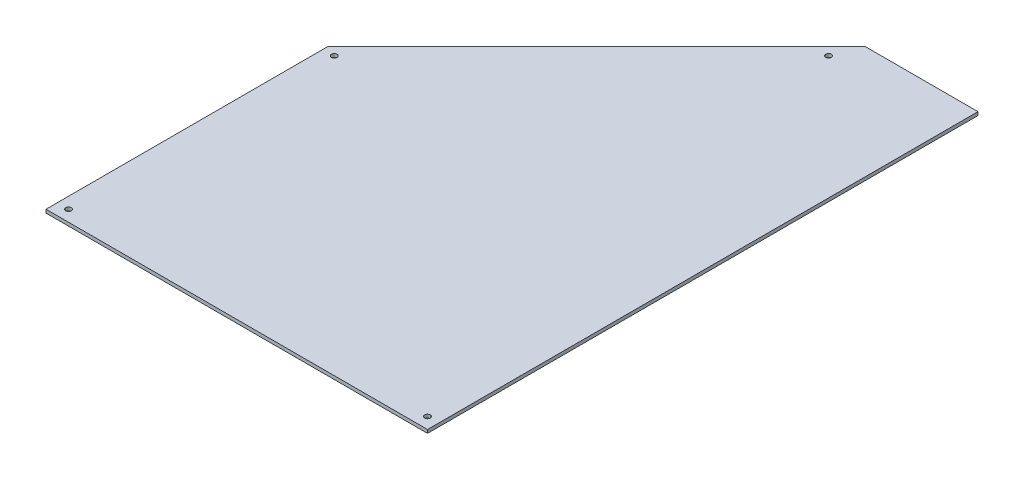
ISO-10303-21;
HEADER;
FILE_DESCRIPTION(('STEP AP214'),'2;1');
FILE_NAME('part.step','',(''),(''),'','','');
FILE_SCHEMA(('AUTOMOTIVE_DESIGN { 1 0 10303 214 1 1 1 1 }'));
ENDSEC;
DATA;
#1=APPLICATION_CONTEXT('core data for automotive mechanical design processes');
#2=APPLICATION_PROTOCOL_DEFINITION('international standard','automotive_design',2000,#1);
#3=PRODUCT_CONTEXT('',#1,'mechanical');
#4=PRODUCT('Part','Part','',(#3));
#5=PRODUCT_RELATED_PRODUCT_CATEGORY('part','',(#4));
#6=PRODUCT_DEFINITION_FORMATION('','',#4);
#7=PRODUCT_DEFINITION_CONTEXT('part definition',#1,'design');
#8=PRODUCT_DEFINITION('design','',#6,#7);
#9=PRODUCT_DEFINITION_SHAPE('','',#8);
#10=(LENGTH_UNIT() NAMED_UNIT(*) SI_UNIT(.MILLI.,.METRE.));
#11=(NAMED_UNIT(*) PLANE_ANGLE_UNIT() SI_UNIT($,.RADIAN.));
#12=(NAMED_UNIT(*) SI_UNIT($,.STERADIAN.) SOLID_ANGLE_UNIT());
#13=UNCERTAINTY_MEASURE_WITH_UNIT(LENGTH_MEASURE(1.E-05),#10,'distance_accuracy_value','');
#14=(GEOMETRIC_REPRESENTATION_CONTEXT(3) GLOBAL_UNCERTAINTY_ASSIGNED_CONTEXT((#13)) GLOBAL_UNIT_ASSIGNED_CONTEXT((#10,
#11,#12)) REPRESENTATION_CONTEXT('',''));
#15=CARTESIAN_POINT('',(0.,0.,0.));
#16=DIRECTION('',(0.,0.,1.));
#17=DIRECTION('',(1.,0.,0.));
#18=AXIS2_PLACEMENT_3D('',#15,#16,#17);
#19=CARTESIAN_POINT('',(488.610000000005,3.,-488.610000000001));
#20=DIRECTION('',(-1.,0.,0.));
#21=DIRECTION('',(0.,0.,1.));
#22=AXIS2_PLACEMENT_3D('',#19,#20,#21);
#23=PLANE('',#22);
#24=DIRECTION('',(0.,0.,-1.));
#25=VECTOR('',#24,1.);
#26=CARTESIAN_POINT('',(488.610000000005,0.,-488.610000000001));
#27=LINE('',#26,#25);
#28=CARTESIAN_POINT('',(488.610000000005,0.,0.));
#29=VERTEX_POINT('',#28);
#30=CARTESIAN_POINT('',(488.610000000005,0.,-488.610000000001));
#31=VERTEX_POINT('',#30);
#32=EDGE_CURVE('E108',#29,#31,#27,.T.);
#33=ORIENTED_EDGE('',*,*,#32,.T.);
#34=DIRECTION('',(0.,-1.,0.));
#35=VECTOR('',#34,1.);
#36=CARTESIAN_POINT('',(488.610000000005,3.,-488.610000000001));
#37=LINE('',#36,#35);
#38=CARTESIAN_POINT('',(488.610000000005,3.,-488.610000000001));
#39=VERTEX_POINT('',#38);
#40=EDGE_CURVE('E11',#39,#31,#37,.T.);
#41=ORIENTED_EDGE('',*,*,#40,.F.);
#42=DIRECTION('',(0.,0.,-1.));
#43=VECTOR('',#42,1.);
#44=CARTESIAN_POINT('',(488.610000000005,3.,-488.610000000001));
#45=LINE('',#44,#43);
#46=CARTESIAN_POINT('',(488.610000000005,3.,0.));
#47=VERTEX_POINT('',#46);
#48=EDGE_CURVE('E117',#47,#39,#45,.T.);
#49=ORIENTED_EDGE('',*,*,#48,.F.);
#50=DIRECTION('',(0.,-1.,0.));
#51=VECTOR('',#50,1.);
#52=CARTESIAN_POINT('',(488.610000000005,3.,0.));
#53=LINE('',#52,#51);
#54=EDGE_CURVE('E104',#47,#29,#53,.T.);
#55=ORIENTED_EDGE('',*,*,#54,.T.);
#56=EDGE_LOOP('',(#33,#41,#49,#55));
#57=FACE_BOUND('',#56,.T.);
#58=ADVANCED_FACE('F34',(#57),#23,.F.);
#59=CARTESIAN_POINT('',(388.610000000005,3.,-488.610000000001));
#60=DIRECTION('',(0.,0.,1.));
#61=DIRECTION('',(1.,0.,0.));
#62=AXIS2_PLACEMENT_3D('',#59,#60,#61);
#63=PLANE('',#62);
#64=DIRECTION('',(-1.,0.,0.));
#65=VECTOR('',#64,1.);
#66=CARTESIAN_POINT('',(388.610000000005,0.,-488.610000000001));
#67=LINE('',#66,#65);
#68=CARTESIAN_POINT('',(388.610000000005,0.,-488.610000000001));
#69=VERTEX_POINT('',#68);
#70=EDGE_CURVE('E111',#31,#69,#67,.T.);
#71=ORIENTED_EDGE('',*,*,#70,.T.);
#72=DIRECTION('',(0.,-1.,0.));
#73=VECTOR('',#72,1.);
#74=CARTESIAN_POINT('',(388.610000000005,3.,-488.610000000001));
#75=LINE('',#74,#73);
#76=CARTESIAN_POINT('',(388.610000000005,3.,-488.610000000001));
#77=VERTEX_POINT('',#76);
#78=EDGE_CURVE('E42',#77,#69,#75,.T.);
#79=ORIENTED_EDGE('',*,*,#78,.F.);
#80=DIRECTION('',(-1.,0.,0.));
#81=VECTOR('',#80,1.);
#82=CARTESIAN_POINT('',(388.610000000005,3.,-488.610000000001));
#83=LINE('',#82,#81);
#84=EDGE_CURVE('E84',#39,#77,#83,.T.);
#85=ORIENTED_EDGE('',*,*,#84,.F.);
#86=ORIENTED_EDGE('',*,*,#40,.T.);
#87=EDGE_LOOP('',(#71,#79,#85,#86));
#88=FACE_BOUND('',#87,.T.);
#89=ADVANCED_FACE('F137',(#88),#63,.F.);
#90=CARTESIAN_POINT('',(150.,3.,-249.999999999998));
#91=DIRECTION('',(0.707106781186544,0.,0.707106781186551));
#92=DIRECTION('',(0.707106781186551,0.,-0.707106781186544));
#93=AXIS2_PLACEMENT_3D('',#90,#91,#92);
#94=PLANE('',#93);
#95=DIRECTION('',(-0.707106781186551,0.,0.707106781186544));
#96=VECTOR('',#95,1.);
#97=CARTESIAN_POINT('',(150.,0.,-249.999999999998));
#98=LINE('',#97,#96);
#99=CARTESIAN_POINT('',(150.,0.,-249.999999999998));
#100=VERTEX_POINT('',#99);
#101=EDGE_CURVE('E99',#69,#100,#98,.T.);
#102=ORIENTED_EDGE('',*,*,#101,.T.);
#103=DIRECTION('',(0.,-1.,0.));
#104=VECTOR('',#103,1.);
#105=CARTESIAN_POINT('',(150.,3.,-249.999999999998));
#106=LINE('',#105,#104);
#107=CARTESIAN_POINT('',(150.,3.,-249.999999999998));
#108=VERTEX_POINT('',#107);
#109=EDGE_CURVE('E96',#108,#100,#106,.T.);
#110=ORIENTED_EDGE('',*,*,#109,.F.);
#111=DIRECTION('',(-0.707106781186551,0.,0.707106781186544));
#112=VECTOR('',#111,1.);
#113=CARTESIAN_POINT('',(150.,3.,-249.999999999998));
#114=LINE('',#113,#112);
#115=EDGE_CURVE('E88',#77,#108,#114,.T.);
#116=ORIENTED_EDGE('',*,*,#115,.F.);
#117=ORIENTED_EDGE('',*,*,#78,.T.);
#118=EDGE_LOOP('',(#102,#110,#116,#117));
#119=FACE_BOUND('',#118,.T.);
#120=ADVANCED_FACE('F97',(#119),#94,.F.);
#121=CARTESIAN_POINT('',(150.,3.,0.));
#122=DIRECTION('',(1.,0.,0.));
#123=DIRECTION('',(0.,0.,-1.));
#124=AXIS2_PLACEMENT_3D('',#121,#122,#123);
#125=PLANE('',#124);
#126=DIRECTION('',(0.,0.,1.));
#127=VECTOR('',#126,1.);
#128=CARTESIAN_POINT('',(150.,0.,0.));
#129=LINE('',#128,#127);
#130=CARTESIAN_POINT('',(150.,0.,0.));
#131=VERTEX_POINT('',#130);
#132=EDGE_CURVE('E70',#100,#131,#129,.T.);
#133=ORIENTED_EDGE('',*,*,#132,.T.);
#134=DIRECTION('',(0.,-1.,0.));
#135=VECTOR('',#134,1.);
#136=CARTESIAN_POINT('',(150.,3.,0.));
#137=LINE('',#136,#135);
#138=CARTESIAN_POINT('',(150.,3.,0.));
#139=VERTEX_POINT('',#138);
#140=EDGE_CURVE('E100',#139,#131,#137,.T.);
#141=ORIENTED_EDGE('',*,*,#140,.F.);
#142=DIRECTION('',(0.,0.,1.));
#143=VECTOR('',#142,1.);
#144=CARTESIAN_POINT('',(150.,3.,0.));
#145=LINE('',#144,#143);
#146=EDGE_CURVE('E92',#108,#139,#145,.T.);
#147=ORIENTED_EDGE('',*,*,#146,.F.);
#148=ORIENTED_EDGE('',*,*,#109,.T.);
#149=EDGE_LOOP('',(#133,#141,#147,#148));
#150=FACE_BOUND('',#149,.T.);
#151=ADVANCED_FACE('F102',(#150),#125,.F.);
#152=CARTESIAN_POINT('',(488.610000000005,3.,0.));
#153=DIRECTION('',(0.,0.,-1.));
#154=DIRECTION('',(-1.,0.,0.));
#155=AXIS2_PLACEMENT_3D('',#152,#153,#154);
#156=PLANE('',#155);
#157=DIRECTION('',(1.,0.,0.));
#158=VECTOR('',#157,1.);
#159=CARTESIAN_POINT('',(488.610000000005,0.,0.));
#160=LINE('',#159,#158);
#161=EDGE_CURVE('E76',#131,#29,#160,.T.);
#162=ORIENTED_EDGE('',*,*,#161,.T.);
#163=ORIENTED_EDGE('',*,*,#54,.F.);
#164=DIRECTION('',(1.,0.,0.));
#165=VECTOR('',#164,1.);
#166=CARTESIAN_POINT('',(488.610000000005,3.,0.));
#167=LINE('',#166,#165);
#168=EDGE_CURVE('E50',#139,#47,#167,.T.);
#169=ORIENTED_EDGE('',*,*,#168,.F.);
#170=ORIENTED_EDGE('',*,*,#140,.T.);
#171=EDGE_LOOP('',(#162,#163,#169,#170));
#172=FACE_BOUND('',#171,.T.);
#173=ADVANCED_FACE('F125',(#172),#156,.F.);
#174=CARTESIAN_POINT('',(0.,3.,0.));
#175=DIRECTION('',(0.,-1.,0.));
#176=DIRECTION('',(0.,0.,-1.));
#177=AXIS2_PLACEMENT_3D('',#174,#175,#176);
#178=PLANE('',#177);
#179=CARTESIAN_POINT('',(379.368855680987,3.,-465.226720057252));
#180=DIRECTION('',(0.,1.,0.));
#181=DIRECTION('',(0.,0.,1.));
#182=AXIS2_PLACEMENT_3D('',#179,#180,#181);
#183=CIRCLE('',#182,2.49999999999997);
#184=CARTESIAN_POINT('',(379.368855680987,3.,-462.726720057252));
#185=VERTEX_POINT('',#184);
#186=EDGE_CURVE('E219',#185,#185,#183,.T.);
#187=ORIENTED_EDGE('',*,*,#186,.F.);
#188=EDGE_LOOP('',(#187));
#189=FACE_BOUND('',#188,.T.);
#190=CARTESIAN_POINT('',(478.610000000005,3.,-10.));
#191=DIRECTION('',(0.,1.,0.));
#192=DIRECTION('',(0.,0.,1.));
#193=AXIS2_PLACEMENT_3D('',#190,#191,#192);
#194=CIRCLE('',#193,2.50000000000002);
#195=CARTESIAN_POINT('',(478.610000000005,3.,-7.49999999999998));
#196=VERTEX_POINT('',#195);
#197=EDGE_CURVE('E221',#196,#196,#194,.T.);
#198=ORIENTED_EDGE('',*,*,#197,.F.);
#199=EDGE_LOOP('',(#198));
#200=FACE_BOUND('',#199,.T.);
#201=CARTESIAN_POINT('',(160.,3.,-10.));
#202=DIRECTION('',(0.,1.,0.));
#203=DIRECTION('',(0.,0.,1.));
#204=AXIS2_PLACEMENT_3D('',#201,#202,#203);
#205=CIRCLE('',#204,2.49999999999999);
#206=CARTESIAN_POINT('',(160.,3.,-7.50000000000001));
#207=VERTEX_POINT('',#206);
#208=EDGE_CURVE('E234',#207,#207,#205,.T.);
#209=ORIENTED_EDGE('',*,*,#208,.F.);
#210=EDGE_LOOP('',(#209));
#211=FACE_BOUND('',#210,.T.);
#212=CARTESIAN_POINT('',(160.,3.,-245.857864376267));
#213=DIRECTION('',(0.,1.,0.));
#214=DIRECTION('',(0.,0.,1.));
#215=AXIS2_PLACEMENT_3D('',#212,#213,#214);
#216=CIRCLE('',#215,2.5);
#217=CARTESIAN_POINT('',(160.,3.,-243.357864376267));
#218=VERTEX_POINT('',#217);
#219=EDGE_CURVE('E227',#218,#218,#216,.T.);
#220=ORIENTED_EDGE('',*,*,#219,.F.);
#221=EDGE_LOOP('',(#220));
#222=FACE_BOUND('',#221,.T.);
#223=ORIENTED_EDGE('',*,*,#48,.T.);
#224=ORIENTED_EDGE('',*,*,#84,.T.);
#225=ORIENTED_EDGE('',*,*,#115,.T.);
#226=ORIENTED_EDGE('',*,*,#146,.T.);
#227=ORIENTED_EDGE('',*,*,#168,.T.);
#228=EDGE_LOOP('',(#223,#224,#225,#226,#227));
#229=FACE_BOUND('',#228,.T.);
#230=ADVANCED_FACE('F90',(#189,#200,#211,#222,#229),#178,.F.);
#231=CARTESIAN_POINT('',(0.,0.,0.));
#232=DIRECTION('',(0.,-1.,0.));
#233=DIRECTION('',(0.,0.,-1.));
#234=AXIS2_PLACEMENT_3D('',#231,#232,#233);
#235=PLANE('',#234);
#236=CARTESIAN_POINT('',(379.368855680987,0.,-465.226720057252));
#237=DIRECTION('',(0.,1.,0.));
#238=DIRECTION('',(0.,0.,1.));
#239=AXIS2_PLACEMENT_3D('',#236,#237,#238);
#240=CIRCLE('',#239,2.49999999999997);
#241=CARTESIAN_POINT('',(379.368855680987,0.,-462.726720057252));
#242=VERTEX_POINT('',#241);
#243=EDGE_CURVE('E216',#242,#242,#240,.T.);
#244=ORIENTED_EDGE('',*,*,#243,.T.);
#245=EDGE_LOOP('',(#244));
#246=FACE_BOUND('',#245,.T.);
#247=CARTESIAN_POINT('',(478.610000000005,0.,-10.));
#248=DIRECTION('',(0.,1.,0.));
#249=DIRECTION('',(0.,0.,1.));
#250=AXIS2_PLACEMENT_3D('',#247,#248,#249);
#251=CIRCLE('',#250,2.50000000000002);
#252=CARTESIAN_POINT('',(478.610000000005,0.,-7.49999999999998));
#253=VERTEX_POINT('',#252);
#254=EDGE_CURVE('E239',#253,#253,#251,.T.);
#255=ORIENTED_EDGE('',*,*,#254,.T.);
#256=EDGE_LOOP('',(#255));
#257=FACE_BOUND('',#256,.T.);
#258=CARTESIAN_POINT('',(160.,0.,-10.));
#259=DIRECTION('',(0.,1.,0.));
#260=DIRECTION('',(0.,0.,1.));
#261=AXIS2_PLACEMENT_3D('',#258,#259,#260);
#262=CIRCLE('',#261,2.49999999999999);
#263=CARTESIAN_POINT('',(160.,0.,-7.50000000000001));
#264=VERTEX_POINT('',#263);
#265=EDGE_CURVE('E230',#264,#264,#262,.T.);
#266=ORIENTED_EDGE('',*,*,#265,.T.);
#267=EDGE_LOOP('',(#266));
#268=FACE_BOUND('',#267,.T.);
#269=CARTESIAN_POINT('',(160.,0.,-245.857864376267));
#270=DIRECTION('',(0.,1.,0.));
#271=DIRECTION('',(0.,0.,1.));
#272=AXIS2_PLACEMENT_3D('',#269,#270,#271);
#273=CIRCLE('',#272,2.5);
#274=CARTESIAN_POINT('',(160.,0.,-243.357864376267));
#275=VERTEX_POINT('',#274);
#276=EDGE_CURVE('E112',#275,#275,#273,.T.);
#277=ORIENTED_EDGE('',*,*,#276,.T.);
#278=EDGE_LOOP('',(#277));
#279=FACE_BOUND('',#278,.T.);
#280=ORIENTED_EDGE('',*,*,#32,.F.);
#281=ORIENTED_EDGE('',*,*,#161,.F.);
#282=ORIENTED_EDGE('',*,*,#132,.F.);
#283=ORIENTED_EDGE('',*,*,#101,.F.);
#284=ORIENTED_EDGE('',*,*,#70,.F.);
#285=EDGE_LOOP('',(#280,#281,#282,#283,#284));
#286=FACE_BOUND('',#285,.T.);
#287=ADVANCED_FACE('F121',(#246,#257,#268,#279,#286),#235,.T.);
#288=CARTESIAN_POINT('',(160.,0.,-245.857864376267));
#289=DIRECTION('',(0.,1.,0.));
#290=DIRECTION('',(0.,0.,1.));
#291=AXIS2_PLACEMENT_3D('',#288,#289,#290);
#292=CYLINDRICAL_SURFACE('',#291,2.5);
#293=ORIENTED_EDGE('',*,*,#276,.F.);
#294=EDGE_LOOP('',(#293));
#295=FACE_BOUND('',#294,.T.);
#296=ORIENTED_EDGE('',*,*,#219,.T.);
#297=EDGE_LOOP('',(#296));
#298=FACE_BOUND('',#297,.T.);
#299=ADVANCED_FACE('F170',(#295,#298),#292,.F.);
#300=CARTESIAN_POINT('',(160.,0.,-10.));
#301=DIRECTION('',(0.,1.,0.));
#302=DIRECTION('',(0.,0.,1.));
#303=AXIS2_PLACEMENT_3D('',#300,#301,#302);
#304=CYLINDRICAL_SURFACE('',#303,2.49999999999999);
#305=ORIENTED_EDGE('',*,*,#265,.F.);
#306=EDGE_LOOP('',(#305));
#307=FACE_BOUND('',#306,.T.);
#308=ORIENTED_EDGE('',*,*,#208,.T.);
#309=EDGE_LOOP('',(#308));
#310=FACE_BOUND('',#309,.T.);
#311=ADVANCED_FACE('F179',(#307,#310),#304,.F.);
#312=CARTESIAN_POINT('',(478.610000000005,0.,-10.));
#313=DIRECTION('',(0.,1.,0.));
#314=DIRECTION('',(0.,0.,1.));
#315=AXIS2_PLACEMENT_3D('',#312,#313,#314);
#316=CYLINDRICAL_SURFACE('',#315,2.50000000000002);
#317=ORIENTED_EDGE('',*,*,#254,.F.);
#318=EDGE_LOOP('',(#317));
#319=FACE_BOUND('',#318,.T.);
#320=ORIENTED_EDGE('',*,*,#197,.T.);
#321=EDGE_LOOP('',(#320));
#322=FACE_BOUND('',#321,.T.);
#323=ADVANCED_FACE('F189',(#319,#322),#316,.F.);
#324=CARTESIAN_POINT('',(379.368855680987,0.,-465.226720057252));
#325=DIRECTION('',(0.,1.,0.));
#326=DIRECTION('',(0.,0.,1.));
#327=AXIS2_PLACEMENT_3D('',#324,#325,#326);
#328=CYLINDRICAL_SURFACE('',#327,2.49999999999997);
#329=ORIENTED_EDGE('',*,*,#243,.F.);
#330=EDGE_LOOP('',(#329));
#331=FACE_BOUND('',#330,.T.);
#332=ORIENTED_EDGE('',*,*,#186,.T.);
#333=EDGE_LOOP('',(#332));
#334=FACE_BOUND('',#333,.T.);
#335=ADVANCED_FACE('F199',(#331,#334),#328,.F.);
#336=CLOSED_SHELL('',(#58,#89,#120,#151,#173,#230,#287,#299,#311,#323,#335));
#337=MANIFOLD_SOLID_BREP('B2',#336);
#338=ADVANCED_BREP_SHAPE_REPRESENTATION('',(#18,#337),#14);
#339=SHAPE_DEFINITION_REPRESENTATION(#9,#338);
ENDSEC;
END-ISO-10303-21;
